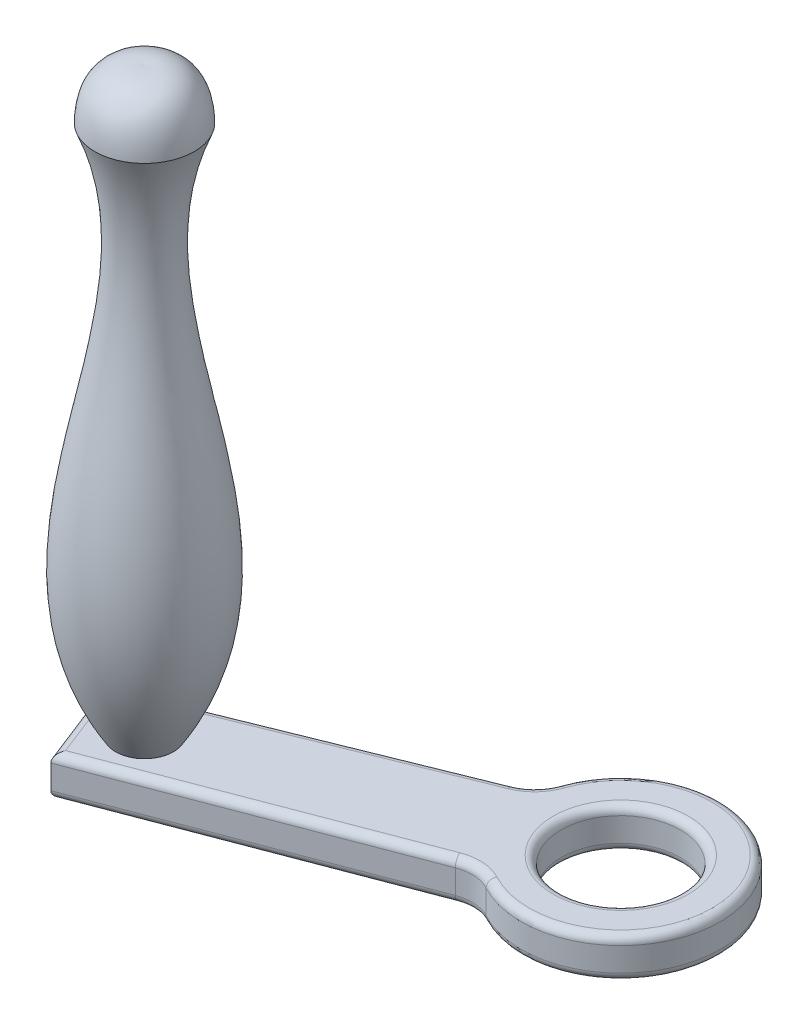
ISO-10303-21;
HEADER;
FILE_DESCRIPTION(('STEP AP214'),'2;1');
FILE_NAME('part.step','',(''),(''),'','','');
FILE_SCHEMA(('AUTOMOTIVE_DESIGN { 1 0 10303 214 1 1 1 1 }'));
ENDSEC;
DATA;
#1=APPLICATION_CONTEXT('core data for automotive mechanical design processes');
#2=APPLICATION_PROTOCOL_DEFINITION('international standard','automotive_design',2000,#1);
#3=PRODUCT_CONTEXT('',#1,'mechanical');
#4=PRODUCT('Part','Part','',(#3));
#5=PRODUCT_RELATED_PRODUCT_CATEGORY('part','',(#4));
#6=PRODUCT_DEFINITION_FORMATION('','',#4);
#7=PRODUCT_DEFINITION_CONTEXT('part definition',#1,'design');
#8=PRODUCT_DEFINITION('design','',#6,#7);
#9=PRODUCT_DEFINITION_SHAPE('','',#8);
#10=(LENGTH_UNIT() NAMED_UNIT(*) SI_UNIT(.MILLI.,.METRE.));
#11=(NAMED_UNIT(*) PLANE_ANGLE_UNIT() SI_UNIT($,.RADIAN.));
#12=(NAMED_UNIT(*) SI_UNIT($,.STERADIAN.) SOLID_ANGLE_UNIT());
#13=UNCERTAINTY_MEASURE_WITH_UNIT(LENGTH_MEASURE(1.E-05),#10,'distance_accuracy_value','');
#14=(GEOMETRIC_REPRESENTATION_CONTEXT(3) GLOBAL_UNCERTAINTY_ASSIGNED_CONTEXT((#13)) GLOBAL_UNIT_ASSIGNED_CONTEXT((#10,
#11,#12)) REPRESENTATION_CONTEXT('',''));
#15=CARTESIAN_POINT('',(0.,0.,0.));
#16=DIRECTION('',(0.,0.,1.));
#17=DIRECTION('',(1.,0.,0.));
#18=AXIS2_PLACEMENT_3D('',#15,#16,#17);
#19=CARTESIAN_POINT('',(-12.6687164985265,10.,146.410218970979));
#20=DIRECTION('',(0.,-1.,0.));
#21=DIRECTION('',(0.,0.,-1.));
#22=AXIS2_PLACEMENT_3D('',#19,#20,#21);
#23=PLANE('',#22);
#24=CARTESIAN_POINT('',(3.80708820162256,10.,115.530648710327));
#25=DIRECTION('',(0.,-1.,0.));
#26=DIRECTION('',(0.,0.,-1.));
#27=AXIS2_PLACEMENT_3D('',#24,#25,#26);
#28=CIRCLE('',#27,17.);
#29=CARTESIAN_POINT('',(3.80708820162256,10.,98.530648710327));
#30=VERTEX_POINT('',#29);
#31=EDGE_CURVE('P0_E11',#30,#30,#28,.T.);
#32=ORIENTED_EDGE('',*,*,#31,.T.);
#33=EDGE_LOOP('',(#32));
#34=FACE_BOUND('',#33,.T.);
#35=CARTESIAN_POINT('',(-29.2669525553891,10.,104.080416048781));
#36=DIRECTION('',(0.,-1.,0.));
#37=DIRECTION('',(0.,0.,-1.));
#38=AXIS2_PLACEMENT_3D('',#35,#36,#37);
#39=CIRCLE('',#38,12.);
#40=CARTESIAN_POINT('',(-17.9272814386994,10.,108.006210104168));
#41=VERTEX_POINT('',#40);
#42=CARTESIAN_POINT('',(-24.7742989756306,10.,115.207682730778));
#43=VERTEX_POINT('',#42);
#44=EDGE_CURVE('P0_E34',#41,#43,#39,.T.);
#45=ORIENTED_EDGE('',*,*,#44,.T.);
#46=DIRECTION('',(-0.927272223499759,0.,0.37438779831321));
#47=VECTOR('',#46,1.);
#48=CARTESIAN_POINT('',(-25.1977642307883,10.,115.378657575622));
#49=LINE('',#48,#47);
#50=CARTESIAN_POINT('',(-95.9644544726669,10.,143.950833773863));
#51=VERTEX_POINT('',#50);
#52=EDGE_CURVE('P0_E26',#43,#51,#49,.T.);
#53=ORIENTED_EDGE('',*,*,#52,.T.);
#54=DIRECTION('',(0.365055377330946,0.,0.930985806272986));
#55=VECTOR('',#54,1.);
#56=CARTESIAN_POINT('',(-84.0281622235487,10.,174.391471971561));
#57=LINE('',#56,#55);
#58=CARTESIAN_POINT('',(-88.6901060312929,10.,162.502307247061));
#59=VERTEX_POINT('',#58);
#60=EDGE_CURVE('P0_E173',#51,#59,#57,.T.);
#61=ORIENTED_EDGE('',*,*,#60,.T.);
#62=DIRECTION('',(0.934605466749449,0.,-0.355686127817834));
#63=VECTOR('',#62,1.);
#64=CARTESIAN_POINT('',(-16.9369500323406,10.,135.194953369986));
#65=LINE('',#64,#63);
#66=CARTESIAN_POINT('',(-16.9369500323406,10.,135.194953369986));
#67=VERTEX_POINT('',#66);
#68=EDGE_CURVE('P0_E175',#59,#67,#65,.T.);
#69=ORIENTED_EDGE('',*,*,#68,.T.);
#70=CARTESIAN_POINT('',(-12.6687164985265,10.,146.410218970979));
#71=DIRECTION('',(0.,-1.,0.));
#72=DIRECTION('',(0.,0.,-1.));
#73=AXIS2_PLACEMENT_3D('',#70,#71,#72);
#74=CIRCLE('',#73,12.);
#75=CARTESIAN_POINT('',(-7.01986917276113,10.,135.822937738756));
#76=VERTEX_POINT('',#75);
#77=EDGE_CURVE('P0_E177',#67,#76,#74,.T.);
#78=ORIENTED_EDGE('',*,*,#77,.T.);
#79=CARTESIAN_POINT('',(3.80708820162256,10.,115.530648710327));
#80=DIRECTION('',(0.,-1.,0.));
#81=DIRECTION('',(0.,0.,-1.));
#82=AXIS2_PLACEMENT_3D('',#79,#80,#81);
#83=CIRCLE('',#82,23.);
#84=EDGE_CURVE('P0_E39',#76,#41,#83,.F.);
#85=ORIENTED_EDGE('',*,*,#84,.T.);
#86=EDGE_LOOP('',(#45,#53,#61,#69,#78,#85));
#87=FACE_BOUND('',#86,.T.);
#88=ADVANCED_FACE('P0_F17',(#34,#87),#23,.F.);
#89=CARTESIAN_POINT('',(-12.6687164985265,0.,146.410218970979));
#90=DIRECTION('',(0.,-1.,0.));
#91=DIRECTION('',(0.,0.,-1.));
#92=AXIS2_PLACEMENT_3D('',#89,#90,#91);
#93=PLANE('',#92);
#94=CARTESIAN_POINT('',(3.80708820162256,0.,115.530648710327));
#95=DIRECTION('',(0.,-1.,0.));
#96=DIRECTION('',(0.,0.,-1.));
#97=AXIS2_PLACEMENT_3D('',#94,#95,#96);
#98=CIRCLE('',#97,17.);
#99=CARTESIAN_POINT('',(3.80708820162256,0.,98.530648710327));
#100=VERTEX_POINT('',#99);
#101=EDGE_CURVE('P0_E135',#100,#100,#98,.F.);
#102=ORIENTED_EDGE('',*,*,#101,.T.);
#103=EDGE_LOOP('',(#102));
#104=FACE_BOUND('',#103,.T.);
#105=CARTESIAN_POINT('',(-12.6687164985265,0.,146.410218970979));
#106=DIRECTION('',(0.,-1.,0.));
#107=DIRECTION('',(0.,0.,-1.));
#108=AXIS2_PLACEMENT_3D('',#105,#106,#107);
#109=CIRCLE('',#108,12.);
#110=CARTESIAN_POINT('',(-7.01986917276115,0.,135.822937738756));
#111=VERTEX_POINT('',#110);
#112=CARTESIAN_POINT('',(-16.9369500323406,0.,135.194953369986));
#113=VERTEX_POINT('',#112);
#114=EDGE_CURVE('P0_E134',#111,#113,#109,.F.);
#115=ORIENTED_EDGE('',*,*,#114,.T.);
#116=DIRECTION('',(0.934605466749449,0.,-0.355686127817834));
#117=VECTOR('',#116,1.);
#118=CARTESIAN_POINT('',(-90.5406359275986,0.,163.206569993904));
#119=LINE('',#118,#117);
#120=CARTESIAN_POINT('',(-88.6901060312929,0.,162.502307247061));
#121=VERTEX_POINT('',#120);
#122=EDGE_CURVE('P0_E113',#113,#121,#119,.F.);
#123=ORIENTED_EDGE('',*,*,#122,.T.);
#124=DIRECTION('',(0.365055377330946,0.,0.930985806272986));
#125=VECTOR('',#124,1.);
#126=CARTESIAN_POINT('',(-96.6872684445428,0.,142.107470848182));
#127=LINE('',#126,#125);
#128=CARTESIAN_POINT('',(-95.964454472667,0.,143.950833773863));
#129=VERTEX_POINT('',#128);
#130=EDGE_CURVE('P0_E123',#121,#129,#127,.F.);
#131=ORIENTED_EDGE('',*,*,#130,.T.);
#132=DIRECTION('',(-0.927272223499759,0.,0.37438779831321));
#133=VECTOR('',#132,1.);
#134=CARTESIAN_POINT('',(-24.7742989756306,0.,115.207682730778));
#135=LINE('',#134,#133);
#136=CARTESIAN_POINT('',(-24.7742989756306,0.,115.207682730778));
#137=VERTEX_POINT('',#136);
#138=EDGE_CURVE('P0_E129',#129,#137,#135,.F.);
#139=ORIENTED_EDGE('',*,*,#138,.T.);
#140=CARTESIAN_POINT('',(-29.2669525553891,0.,104.080416048781));
#141=DIRECTION('',(0.,-1.,0.));
#142=DIRECTION('',(0.,0.,-1.));
#143=AXIS2_PLACEMENT_3D('',#140,#141,#142);
#144=CIRCLE('',#143,12.);
#145=CARTESIAN_POINT('',(-17.9272814386994,0.,108.006210104168));
#146=VERTEX_POINT('',#145);
#147=EDGE_CURVE('P0_E235',#137,#146,#144,.F.);
#148=ORIENTED_EDGE('',*,*,#147,.T.);
#149=CARTESIAN_POINT('',(3.80708820162256,0.,115.530648710327));
#150=DIRECTION('',(0.,-1.,0.));
#151=DIRECTION('',(0.,0.,-1.));
#152=AXIS2_PLACEMENT_3D('',#149,#150,#151);
#153=CIRCLE('',#152,23.);
#154=EDGE_CURVE('P0_E140',#146,#111,#153,.T.);
#155=ORIENTED_EDGE('',*,*,#154,.T.);
#156=EDGE_LOOP('',(#115,#123,#131,#139,#148,#155));
#157=FACE_BOUND('',#156,.T.);
#158=ADVANCED_FACE('P0_F132',(#104,#157),#93,.T.);
#159=CARTESIAN_POINT('',(-98.5492400570888,10.,142.837581602844));
#160=DIRECTION('',(0.930985806272986,0.,-0.365055377330945));
#161=DIRECTION('',(-0.365055377330946,0.,-0.930985806272986));
#162=AXIS2_PLACEMENT_3D('',#159,#160,#161);
#163=PLANE('',#162);
#164=DIRECTION('',(0.,-1.,0.));
#165=VECTOR('',#164,1.);
#166=CARTESIAN_POINT('',(-98.5492400570888,10.,142.837581602844));
#167=LINE('',#166,#165);
#168=CARTESIAN_POINT('',(-98.5492400570888,8.,142.837581602844));
#169=VERTEX_POINT('',#168);
#170=CARTESIAN_POINT('',(-98.5492400570888,2.,142.837581602844));
#171=VERTEX_POINT('',#170);
#172=EDGE_CURVE('P0_E192',#169,#171,#167,.T.);
#173=ORIENTED_EDGE('',*,*,#172,.T.);
#174=DIRECTION('',(0.365055377330946,0.,0.930985806272986));
#175=VECTOR('',#174,1.);
#176=CARTESIAN_POINT('',(-89.829263671963,2.,165.075780927403));
#177=LINE('',#176,#175);
#178=CARTESIAN_POINT('',(-89.829263671963,2.,165.075780927403));
#179=VERTEX_POINT('',#178);
#180=EDGE_CURVE('P0_E171',#171,#179,#177,.T.);
#181=ORIENTED_EDGE('',*,*,#180,.T.);
#182=DIRECTION('',(0.,-1.,0.));
#183=VECTOR('',#182,1.);
#184=CARTESIAN_POINT('',(-89.829263671963,10.,165.075780927403));
#185=LINE('',#184,#183);
#186=CARTESIAN_POINT('',(-89.829263671963,8.,165.075780927403));
#187=VERTEX_POINT('',#186);
#188=EDGE_CURVE('P0_E130',#187,#179,#185,.T.);
#189=ORIENTED_EDGE('',*,*,#188,.F.);
#190=DIRECTION('',(0.365055377330946,0.,0.930985806272986));
#191=VECTOR('',#190,1.);
#192=CARTESIAN_POINT('',(-98.5492400570888,8.,142.837581602844));
#193=LINE('',#192,#191);
#194=EDGE_CURVE('P0_E169',#187,#169,#193,.F.);
#195=ORIENTED_EDGE('',*,*,#194,.T.);
#196=EDGE_LOOP('',(#173,#181,#189,#195));
#197=FACE_BOUND('',#196,.T.);
#198=ADVANCED_FACE('P0_F259',(#197),#163,.F.);
#199=CARTESIAN_POINT('',(-89.829263671963,10.,165.075780927403));
#200=DIRECTION('',(-0.355686127817834,0.,-0.934605466749449));
#201=DIRECTION('',(-0.934605466749449,0.,0.355686127817834));
#202=AXIS2_PLACEMENT_3D('',#199,#200,#201);
#203=PLANE('',#202);
#204=ORIENTED_EDGE('',*,*,#188,.T.);
#205=DIRECTION('',(0.934605466749449,0.,-0.355686127817834));
#206=VECTOR('',#205,1.);
#207=CARTESIAN_POINT('',(-16.2255777767048,2.,137.064164303485));
#208=LINE('',#207,#206);
#209=CARTESIAN_POINT('',(-16.2255777767048,2.,137.064164303485));
#210=VERTEX_POINT('',#209);
#211=EDGE_CURVE('P0_E116',#179,#210,#208,.T.);
#212=ORIENTED_EDGE('',*,*,#211,.T.);
#213=DIRECTION('',(0.,-1.,0.));
#214=VECTOR('',#213,1.);
#215=CARTESIAN_POINT('',(-16.2255777767048,10.,137.064164303485));
#216=LINE('',#215,#214);
#217=CARTESIAN_POINT('',(-16.2255777767048,8.,137.064164303485));
#218=VERTEX_POINT('',#217);
#219=EDGE_CURVE('P0_E221',#218,#210,#216,.T.);
#220=ORIENTED_EDGE('',*,*,#219,.F.);
#221=DIRECTION('',(0.934605466749449,0.,-0.355686127817834));
#222=VECTOR('',#221,1.);
#223=CARTESIAN_POINT('',(-89.829263671963,8.,165.075780927403));
#224=LINE('',#223,#222);
#225=EDGE_CURVE('P0_E149',#218,#187,#224,.F.);
#226=ORIENTED_EDGE('',*,*,#225,.T.);
#227=EDGE_LOOP('',(#204,#212,#220,#226));
#228=FACE_BOUND('',#227,.T.);
#229=ADVANCED_FACE('P0_F226',(#228),#203,.F.);
#230=CARTESIAN_POINT('',(-12.6687164985265,10.,146.410218970979));
#231=DIRECTION('',(0.,-1.,0.));
#232=DIRECTION('',(0.,0.,-1.));
#233=AXIS2_PLACEMENT_3D('',#230,#231,#232);
#234=CYLINDRICAL_SURFACE('',#233,10.);
#235=ORIENTED_EDGE('',*,*,#219,.T.);
#236=CARTESIAN_POINT('',(-12.6687164985265,2.,146.410218970979));
#237=DIRECTION('',(0.,-1.,0.));
#238=DIRECTION('',(0.,0.,-1.));
#239=AXIS2_PLACEMENT_3D('',#236,#237,#238);
#240=CIRCLE('',#239,10.);
#241=CARTESIAN_POINT('',(-7.96134372705537,2.,137.587484610793));
#242=VERTEX_POINT('',#241);
#243=EDGE_CURVE('P0_E154',#210,#242,#240,.T.);
#244=ORIENTED_EDGE('',*,*,#243,.T.);
#245=DIRECTION('',(0.,-1.,0.));
#246=VECTOR('',#245,1.);
#247=CARTESIAN_POINT('',(-7.96134372705537,10.,137.587484610793));
#248=LINE('',#247,#246);
#249=CARTESIAN_POINT('',(-7.96134372705537,8.,137.587484610793));
#250=VERTEX_POINT('',#249);
#251=EDGE_CURVE('P0_E223',#250,#242,#248,.T.);
#252=ORIENTED_EDGE('',*,*,#251,.F.);
#253=CARTESIAN_POINT('',(-12.6687164985265,8.,146.410218970979));
#254=DIRECTION('',(0.,-1.,0.));
#255=DIRECTION('',(0.,0.,-1.));
#256=AXIS2_PLACEMENT_3D('',#253,#254,#255);
#257=CIRCLE('',#256,10.);
#258=EDGE_CURVE('P0_E152',#250,#218,#257,.F.);
#259=ORIENTED_EDGE('',*,*,#258,.T.);
#260=EDGE_LOOP('',(#235,#244,#252,#259));
#261=FACE_BOUND('',#260,.T.);
#262=ADVANCED_FACE('P0_F220',(#261),#234,.F.);
#263=CARTESIAN_POINT('',(3.80708820162256,10.,115.530648710327));
#264=DIRECTION('',(0.,-1.,0.));
#265=DIRECTION('',(0.,0.,-1.));
#266=AXIS2_PLACEMENT_3D('',#263,#264,#265);
#267=CYLINDRICAL_SURFACE('',#266,25.);
#268=ORIENTED_EDGE('',*,*,#251,.T.);
#269=CARTESIAN_POINT('',(3.80708820162256,2.,115.530648710327));
#270=DIRECTION('',(0.,-1.,0.));
#271=DIRECTION('',(0.,0.,-1.));
#272=AXIS2_PLACEMENT_3D('',#269,#270,#271);
#273=CIRCLE('',#272,25.);
#274=CARTESIAN_POINT('',(-19.8172266248143,2.,107.351911094937));
#275=VERTEX_POINT('',#274);
#276=EDGE_CURVE('P0_E158',#242,#275,#273,.F.);
#277=ORIENTED_EDGE('',*,*,#276,.T.);
#278=DIRECTION('',(0.,-1.,0.));
#279=VECTOR('',#278,1.);
#280=CARTESIAN_POINT('',(-19.8172266248143,10.,107.351911094937));
#281=LINE('',#280,#279);
#282=CARTESIAN_POINT('',(-19.8172266248143,8.,107.351911094937));
#283=VERTEX_POINT('',#282);
#284=EDGE_CURVE('P0_E230',#283,#275,#281,.T.);
#285=ORIENTED_EDGE('',*,*,#284,.F.);
#286=CARTESIAN_POINT('',(3.80708820162256,8.,115.530648710327));
#287=DIRECTION('',(0.,-1.,0.));
#288=DIRECTION('',(0.,0.,-1.));
#289=AXIS2_PLACEMENT_3D('',#286,#287,#288);
#290=CIRCLE('',#289,25.);
#291=EDGE_CURVE('P0_E156',#283,#250,#290,.T.);
#292=ORIENTED_EDGE('',*,*,#291,.T.);
#293=EDGE_LOOP('',(#268,#277,#285,#292));
#294=FACE_BOUND('',#293,.T.);
#295=ADVANCED_FACE('P0_F247',(#294),#267,.T.);
#296=CARTESIAN_POINT('',(-29.2669525553891,10.,104.080416048781));
#297=DIRECTION('',(0.,-1.,0.));
#298=DIRECTION('',(0.,0.,-1.));
#299=AXIS2_PLACEMENT_3D('',#296,#297,#298);
#300=CYLINDRICAL_SURFACE('',#299,10.);
#301=ORIENTED_EDGE('',*,*,#284,.T.);
#302=CARTESIAN_POINT('',(-29.2669525553891,2.,104.080416048781));
#303=DIRECTION('',(0.,-1.,0.));
#304=DIRECTION('',(0.,0.,-1.));
#305=AXIS2_PLACEMENT_3D('',#302,#303,#304);
#306=CIRCLE('',#305,10.);
#307=CARTESIAN_POINT('',(-25.523074572257,2.,113.353138283779));
#308=VERTEX_POINT('',#307);
#309=EDGE_CURVE('P0_E162',#275,#308,#306,.T.);
#310=ORIENTED_EDGE('',*,*,#309,.T.);
#311=DIRECTION('',(0.,-1.,0.));
#312=VECTOR('',#311,1.);
#313=CARTESIAN_POINT('',(-25.523074572257,10.,113.353138283779));
#314=LINE('',#313,#312);
#315=CARTESIAN_POINT('',(-25.523074572257,8.,113.353138283779));
#316=VERTEX_POINT('',#315);
#317=EDGE_CURVE('P0_E252',#316,#308,#314,.T.);
#318=ORIENTED_EDGE('',*,*,#317,.F.);
#319=CARTESIAN_POINT('',(-29.2669525553891,8.,104.080416048781));
#320=DIRECTION('',(0.,-1.,0.));
#321=DIRECTION('',(0.,0.,-1.));
#322=AXIS2_PLACEMENT_3D('',#319,#320,#321);
#323=CIRCLE('',#322,10.);
#324=EDGE_CURVE('P0_E160',#316,#283,#323,.F.);
#325=ORIENTED_EDGE('',*,*,#324,.T.);
#326=EDGE_LOOP('',(#301,#310,#318,#325));
#327=FACE_BOUND('',#326,.T.);
#328=ADVANCED_FACE('P0_F270',(#327),#300,.F.);
#329=CARTESIAN_POINT('',(-98.5492400570888,10.,142.837581602844));
#330=DIRECTION('',(0.37438779831321,0.,0.927272223499759));
#331=DIRECTION('',(0.927272223499759,0.,-0.37438779831321));
#332=AXIS2_PLACEMENT_3D('',#329,#330,#331);
#333=PLANE('',#332);
#334=ORIENTED_EDGE('',*,*,#317,.T.);
#335=DIRECTION('',(-0.927272223499759,0.,0.37438779831321));
#336=VECTOR('',#335,1.);
#337=CARTESIAN_POINT('',(-98.5492400570888,2.,142.837581602844));
#338=LINE('',#337,#336);
#339=EDGE_CURVE('P0_E167',#308,#171,#338,.T.);
#340=ORIENTED_EDGE('',*,*,#339,.T.);
#341=ORIENTED_EDGE('',*,*,#172,.F.);
#342=DIRECTION('',(-0.927272223499759,0.,0.37438779831321));
#343=VECTOR('',#342,1.);
#344=CARTESIAN_POINT('',(-98.5492400570888,8.,142.837581602844));
#345=LINE('',#344,#343);
#346=EDGE_CURVE('P0_E164',#169,#316,#345,.F.);
#347=ORIENTED_EDGE('',*,*,#346,.T.);
#348=EDGE_LOOP('',(#334,#340,#341,#347));
#349=FACE_BOUND('',#348,.T.);
#350=ADVANCED_FACE('P0_F271',(#349),#333,.F.);
#351=CARTESIAN_POINT('',(3.80708820162256,10.,115.530648710327));
#352=DIRECTION('',(0.,-1.,0.));
#353=DIRECTION('',(0.,0.,-1.));
#354=AXIS2_PLACEMENT_3D('',#351,#352,#353);
#355=CYLINDRICAL_SURFACE('',#354,15.);
#356=CARTESIAN_POINT('',(3.80708820162256,2.,115.530648710327));
#357=DIRECTION('',(0.,-1.,0.));
#358=DIRECTION('',(0.,0.,-1.));
#359=AXIS2_PLACEMENT_3D('',#356,#357,#358);
#360=CIRCLE('',#359,15.);
#361=CARTESIAN_POINT('',(3.80708820162256,2.,100.530648710327));
#362=VERTEX_POINT('',#361);
#363=EDGE_CURVE('P0_E146',#362,#362,#360,.T.);
#364=ORIENTED_EDGE('',*,*,#363,.T.);
#365=EDGE_LOOP('',(#364));
#366=FACE_BOUND('',#365,.T.);
#367=CARTESIAN_POINT('',(3.80708820162256,8.,115.530648710327));
#368=DIRECTION('',(0.,-1.,0.));
#369=DIRECTION('',(0.,0.,-1.));
#370=AXIS2_PLACEMENT_3D('',#367,#368,#369);
#371=CIRCLE('',#370,15.);
#372=CARTESIAN_POINT('',(3.80708820162256,8.,100.530648710327));
#373=VERTEX_POINT('',#372);
#374=EDGE_CURVE('P0_E138',#373,#373,#371,.F.);
#375=ORIENTED_EDGE('',*,*,#374,.T.);
#376=EDGE_LOOP('',(#375));
#377=FACE_BOUND('',#376,.T.);
#378=ADVANCED_FACE('P0_F292',(#366,#377),#355,.F.);
#379=CARTESIAN_POINT('',(3.80708820162256,2.,115.530648710327));
#380=DIRECTION('',(0.,-1.,0.));
#381=DIRECTION('',(0.,0.,-1.));
#382=AXIS2_PLACEMENT_3D('',#379,#380,#381);
#383=TOROIDAL_SURFACE('',#382,17.,2.);
#384=ORIENTED_EDGE('',*,*,#363,.F.);
#385=EDGE_LOOP('',(#384));
#386=FACE_BOUND('',#385,.T.);
#387=ORIENTED_EDGE('',*,*,#101,.F.);
#388=EDGE_LOOP('',(#387));
#389=FACE_BOUND('',#388,.T.);
#390=ADVANCED_FACE('P0_F306',(#386,#389),#383,.T.);
#391=CARTESIAN_POINT('',(-29.2669525553891,2.,104.080416048781));
#392=DIRECTION('',(0.,-1.,0.));
#393=DIRECTION('',(0.,0.,-1.));
#394=AXIS2_PLACEMENT_3D('',#391,#392,#393);
#395=TOROIDAL_SURFACE('',#394,12.,2.);
#396=CARTESIAN_POINT('',(-17.9272814386994,2.,108.006210104168));
#397=DIRECTION('',(0.327149504615598,0.,-0.944972593057475));
#398=DIRECTION('',(-0.944972593057475,0.,-0.327149504615598));
#399=AXIS2_PLACEMENT_3D('',#396,#397,#398);
#400=CIRCLE('',#399,2.);
#401=EDGE_CURVE('P0_E186',#146,#275,#400,.T.);
#402=ORIENTED_EDGE('',*,*,#401,.F.);
#403=ORIENTED_EDGE('',*,*,#147,.F.);
#404=CARTESIAN_POINT('',(-24.7742989756306,2.,115.207682730778));
#405=DIRECTION('',(-0.927272223499759,0.,0.374387798313211));
#406=DIRECTION('',(0.374387798313211,0.,0.927272223499759));
#407=AXIS2_PLACEMENT_3D('',#404,#405,#406);
#408=CIRCLE('',#407,2.);
#409=EDGE_CURVE('P0_E189',#308,#137,#408,.T.);
#410=ORIENTED_EDGE('',*,*,#409,.F.);
#411=ORIENTED_EDGE('',*,*,#309,.F.);
#412=EDGE_LOOP('',(#402,#403,#410,#411));
#413=FACE_BOUND('',#412,.T.);
#414=ADVANCED_FACE('P0_F268',(#413),#395,.T.);
#415=CARTESIAN_POINT('',(-97.8004644604624,2.,144.692126049844));
#416=DIRECTION('',(0.927272223499759,0.,-0.37438779831321));
#417=DIRECTION('',(-0.37438779831321,0.,-0.927272223499759));
#418=AXIS2_PLACEMENT_3D('',#415,#416,#417);
#419=CYLINDRICAL_SURFACE('',#418,2.);
#420=ORIENTED_EDGE('',*,*,#409,.T.);
#421=ORIENTED_EDGE('',*,*,#138,.F.);
#422=CARTESIAN_POINT('',(-95.964454472667,2.,143.950833773863));
#423=DIRECTION('',(0.39556577347541,0.,-0.918437651043771));
#424=DIRECTION('',(-0.918437651043772,0.,-0.39556577347541));
#425=AXIS2_PLACEMENT_3D('',#422,#423,#424);
#426=ELLIPSE('',#425,2.81432885671047,2.);
#427=EDGE_CURVE('P0_E126',#171,#129,#426,.F.);
#428=ORIENTED_EDGE('',*,*,#427,.F.);
#429=ORIENTED_EDGE('',*,*,#339,.F.);
#430=EDGE_LOOP('',(#420,#421,#428,#429));
#431=FACE_BOUND('',#430,.T.);
#432=ADVANCED_FACE('P0_F265',(#431),#419,.T.);
#433=CARTESIAN_POINT('',(3.80708820162256,2.,115.530648710327));
#434=DIRECTION('',(0.,-1.,0.));
#435=DIRECTION('',(0.,0.,-1.));
#436=AXIS2_PLACEMENT_3D('',#433,#434,#435);
#437=TOROIDAL_SURFACE('',#436,23.,2.);
#438=ORIENTED_EDGE('',*,*,#401,.T.);
#439=ORIENTED_EDGE('',*,*,#276,.F.);
#440=CARTESIAN_POINT('',(-7.01986917276115,2.,135.822937738756));
#441=DIRECTION('',(-0.882273436018629,0.,-0.470737277147118));
#442=DIRECTION('',(-0.470737277147118,0.,0.882273436018629));
#443=AXIS2_PLACEMENT_3D('',#440,#441,#442);
#444=CIRCLE('',#443,2.);
#445=EDGE_CURVE('P0_E119',#111,#242,#444,.T.);
#446=ORIENTED_EDGE('',*,*,#445,.F.);
#447=ORIENTED_EDGE('',*,*,#154,.F.);
#448=EDGE_LOOP('',(#438,#439,#446,#447));
#449=FACE_BOUND('',#448,.T.);
#450=ADVANCED_FACE('P0_F242',(#449),#437,.T.);
#451=CARTESIAN_POINT('',(-96.6872684445428,2.,142.107470848182));
#452=DIRECTION('',(-0.365055377330946,0.,-0.930985806272986));
#453=DIRECTION('',(-0.930985806272986,0.,0.365055377330945));
#454=AXIS2_PLACEMENT_3D('',#451,#452,#453);
#455=CYLINDRICAL_SURFACE('',#454,2.);
#456=ORIENTED_EDGE('',*,*,#427,.T.);
#457=ORIENTED_EDGE('',*,*,#130,.F.);
#458=CARTESIAN_POINT('',(-88.6901060312929,2.,162.502307247061));
#459=DIRECTION('',(-0.914418254358033,0.,-0.404770621583146));
#460=DIRECTION('',(0.404770621583146,0.,-0.914418254358033));
#461=AXIS2_PLACEMENT_3D('',#458,#459,#460);
#462=ELLIPSE('',#461,2.81432885671047,2.);
#463=EDGE_CURVE('P0_E109',#179,#121,#462,.F.);
#464=ORIENTED_EDGE('',*,*,#463,.F.);
#465=ORIENTED_EDGE('',*,*,#180,.F.);
#466=EDGE_LOOP('',(#456,#457,#464,#465));
#467=FACE_BOUND('',#466,.T.);
#468=ADVANCED_FACE('P0_F124',(#467),#455,.T.);
#469=CARTESIAN_POINT('',(-12.6687164985265,2.,146.410218970979));
#470=DIRECTION('',(0.,-1.,0.));
#471=DIRECTION('',(0.,0.,-1.));
#472=AXIS2_PLACEMENT_3D('',#469,#470,#471);
#473=TOROIDAL_SURFACE('',#472,12.,2.);
#474=ORIENTED_EDGE('',*,*,#445,.T.);
#475=ORIENTED_EDGE('',*,*,#243,.F.);
#476=CARTESIAN_POINT('',(-16.9369500323406,2.,135.194953369986));
#477=DIRECTION('',(-0.934605466749449,0.,0.355686127817835));
#478=DIRECTION('',(0.355686127817835,0.,0.934605466749449));
#479=AXIS2_PLACEMENT_3D('',#476,#477,#478);
#480=CIRCLE('',#479,2.);
#481=EDGE_CURVE('P0_E120',#113,#210,#480,.T.);
#482=ORIENTED_EDGE('',*,*,#481,.F.);
#483=ORIENTED_EDGE('',*,*,#114,.F.);
#484=EDGE_LOOP('',(#474,#475,#482,#483));
#485=FACE_BOUND('',#484,.T.);
#486=ADVANCED_FACE('P0_F245',(#485),#473,.T.);
#487=CARTESIAN_POINT('',(-90.5406359275986,2.,163.206569993904));
#488=DIRECTION('',(-0.934605466749449,0.,0.355686127817834));
#489=DIRECTION('',(0.355686127817834,0.,0.934605466749449));
#490=AXIS2_PLACEMENT_3D('',#487,#488,#489);
#491=CYLINDRICAL_SURFACE('',#490,2.);
#492=ORIENTED_EDGE('',*,*,#463,.T.);
#493=ORIENTED_EDGE('',*,*,#122,.F.);
#494=ORIENTED_EDGE('',*,*,#481,.T.);
#495=ORIENTED_EDGE('',*,*,#211,.F.);
#496=EDGE_LOOP('',(#492,#493,#494,#495));
#497=FACE_BOUND('',#496,.T.);
#498=ADVANCED_FACE('P0_F111',(#497),#491,.T.);
#499=CARTESIAN_POINT('',(3.80708820162256,8.,115.530648710327));
#500=DIRECTION('',(0.,-1.,0.));
#501=DIRECTION('',(0.,0.,-1.));
#502=AXIS2_PLACEMENT_3D('',#499,#500,#501);
#503=TOROIDAL_SURFACE('',#502,17.,2.);
#504=ORIENTED_EDGE('',*,*,#31,.F.);
#505=EDGE_LOOP('',(#504));
#506=FACE_BOUND('',#505,.T.);
#507=ORIENTED_EDGE('',*,*,#374,.F.);
#508=EDGE_LOOP('',(#507));
#509=FACE_BOUND('',#508,.T.);
#510=ADVANCED_FACE('P0_F312',(#506,#509),#503,.T.);
#511=CARTESIAN_POINT('',(-12.6687164985265,8.,146.410218970979));
#512=DIRECTION('',(0.,-1.,0.));
#513=DIRECTION('',(0.,0.,-1.));
#514=AXIS2_PLACEMENT_3D('',#511,#512,#513);
#515=TOROIDAL_SURFACE('',#514,12.,2.);
#516=CARTESIAN_POINT('',(-16.9369500323406,8.,135.194953369986));
#517=DIRECTION('',(-0.934605466749449,0.,0.355686127817834));
#518=DIRECTION('',(0.355686127817834,0.,0.934605466749449));
#519=AXIS2_PLACEMENT_3D('',#516,#517,#518);
#520=CIRCLE('',#519,2.);
#521=EDGE_CURVE('P0_E202',#218,#67,#520,.T.);
#522=ORIENTED_EDGE('',*,*,#521,.F.);
#523=ORIENTED_EDGE('',*,*,#258,.F.);
#524=CARTESIAN_POINT('',(-7.01986917276113,8.,135.822937738756));
#525=DIRECTION('',(0.882273436018628,0.,0.47073727714712));
#526=DIRECTION('',(0.47073727714712,0.,-0.882273436018628));
#527=AXIS2_PLACEMENT_3D('',#524,#525,#526);
#528=CIRCLE('',#527,2.);
#529=EDGE_CURVE('P0_E21',#76,#250,#528,.T.);
#530=ORIENTED_EDGE('',*,*,#529,.F.);
#531=ORIENTED_EDGE('',*,*,#77,.F.);
#532=EDGE_LOOP('',(#522,#523,#530,#531));
#533=FACE_BOUND('',#532,.T.);
#534=ADVANCED_FACE('P0_F19',(#533),#515,.T.);
#535=CARTESIAN_POINT('',(3.80708820162256,8.,115.530648710327));
#536=DIRECTION('',(0.,-1.,0.));
#537=DIRECTION('',(0.,0.,-1.));
#538=AXIS2_PLACEMENT_3D('',#535,#536,#537);
#539=TOROIDAL_SURFACE('',#538,23.,2.);
#540=ORIENTED_EDGE('',*,*,#529,.T.);
#541=ORIENTED_EDGE('',*,*,#291,.F.);
#542=CARTESIAN_POINT('',(-17.9272814386994,8.,108.006210104168));
#543=DIRECTION('',(-0.327149504615598,0.,0.944972593057475));
#544=DIRECTION('',(0.944972593057475,0.,0.327149504615598));
#545=AXIS2_PLACEMENT_3D('',#542,#543,#544);
#546=CIRCLE('',#545,2.);
#547=EDGE_CURVE('P0_E200',#41,#283,#546,.T.);
#548=ORIENTED_EDGE('',*,*,#547,.F.);
#549=ORIENTED_EDGE('',*,*,#84,.F.);
#550=EDGE_LOOP('',(#540,#541,#548,#549));
#551=FACE_BOUND('',#550,.T.);
#552=ADVANCED_FACE('P0_F212',(#551),#539,.T.);
#553=CARTESIAN_POINT('',(-16.9369500323406,8.,135.194953369986));
#554=DIRECTION('',(0.934605466749449,0.,-0.355686127817834));
#555=DIRECTION('',(-0.355686127817834,0.,-0.934605466749449));
#556=AXIS2_PLACEMENT_3D('',#553,#554,#555);
#557=CYLINDRICAL_SURFACE('',#556,2.);
#558=ORIENTED_EDGE('',*,*,#521,.T.);
#559=ORIENTED_EDGE('',*,*,#68,.F.);
#560=CARTESIAN_POINT('',(-88.6901060312929,8.,162.502307247061));
#561=DIRECTION('',(0.914418254358033,0.,0.404770621583146));
#562=DIRECTION('',(-0.404770621583146,0.,0.914418254358033));
#563=AXIS2_PLACEMENT_3D('',#560,#561,#562);
#564=ELLIPSE('',#563,2.81432885671047,2.);
#565=EDGE_CURVE('P0_E197',#187,#59,#564,.F.);
#566=ORIENTED_EDGE('',*,*,#565,.F.);
#567=ORIENTED_EDGE('',*,*,#225,.F.);
#568=EDGE_LOOP('',(#558,#559,#566,#567));
#569=FACE_BOUND('',#568,.T.);
#570=ADVANCED_FACE('P0_F333',(#569),#557,.T.);
#571=CARTESIAN_POINT('',(-29.2669525553891,8.,104.080416048781));
#572=DIRECTION('',(0.,-1.,0.));
#573=DIRECTION('',(0.,0.,-1.));
#574=AXIS2_PLACEMENT_3D('',#571,#572,#573);
#575=TOROIDAL_SURFACE('',#574,12.,2.);
#576=ORIENTED_EDGE('',*,*,#547,.T.);
#577=ORIENTED_EDGE('',*,*,#324,.F.);
#578=CARTESIAN_POINT('',(-24.7742989756306,8.,115.207682730778));
#579=DIRECTION('',(-0.927272223499759,0.,0.374387798313209));
#580=DIRECTION('',(0.374387798313209,0.,0.927272223499759));
#581=AXIS2_PLACEMENT_3D('',#578,#579,#580);
#582=CIRCLE('',#581,2.);
#583=EDGE_CURVE('P0_E195',#43,#316,#582,.T.);
#584=ORIENTED_EDGE('',*,*,#583,.F.);
#585=ORIENTED_EDGE('',*,*,#44,.F.);
#586=EDGE_LOOP('',(#576,#577,#584,#585));
#587=FACE_BOUND('',#586,.T.);
#588=ADVANCED_FACE('P0_F330',(#587),#575,.T.);
#589=CARTESIAN_POINT('',(-84.0281622235487,8.,174.391471971561));
#590=DIRECTION('',(0.365055377330946,0.,0.930985806272986));
#591=DIRECTION('',(0.930985806272986,0.,-0.365055377330945));
#592=AXIS2_PLACEMENT_3D('',#589,#590,#591);
#593=CYLINDRICAL_SURFACE('',#592,2.);
#594=ORIENTED_EDGE('',*,*,#565,.T.);
#595=ORIENTED_EDGE('',*,*,#60,.F.);
#596=CARTESIAN_POINT('',(-95.964454472667,8.,143.950833773863));
#597=DIRECTION('',(-0.39556577347541,0.,0.918437651043771));
#598=DIRECTION('',(0.918437651043772,0.,0.39556577347541));
#599=AXIS2_PLACEMENT_3D('',#596,#597,#598);
#600=ELLIPSE('',#599,2.81432885671047,2.);
#601=EDGE_CURVE('P0_E193',#169,#51,#600,.F.);
#602=ORIENTED_EDGE('',*,*,#601,.F.);
#603=ORIENTED_EDGE('',*,*,#194,.F.);
#604=EDGE_LOOP('',(#594,#595,#602,#603));
#605=FACE_BOUND('',#604,.T.);
#606=ADVANCED_FACE('P0_F279',(#605),#593,.T.);
#607=CARTESIAN_POINT('',(-25.1977642307883,8.,115.378657575622));
#608=DIRECTION('',(-0.927272223499759,0.,0.37438779831321));
#609=DIRECTION('',(0.37438779831321,0.,0.927272223499759));
#610=AXIS2_PLACEMENT_3D('',#607,#608,#609);
#611=CYLINDRICAL_SURFACE('',#610,2.);
#612=ORIENTED_EDGE('',*,*,#583,.T.);
#613=ORIENTED_EDGE('',*,*,#346,.F.);
#614=ORIENTED_EDGE('',*,*,#601,.T.);
#615=ORIENTED_EDGE('',*,*,#52,.F.);
#616=EDGE_LOOP('',(#612,#613,#614,#615));
#617=FACE_BOUND('',#616,.T.);
#618=ADVANCED_FACE('P0_F274',(#617),#611,.T.);
#619=CLOSED_SHELL('',(#88,#158,#198,#229,#262,#295,#328,#350,#378,#390,#414,#432,#450,#468,#486,
#498,#510,#534,#552,#570,#588,#606,#618));
#620=MANIFOLD_SOLID_BREP('P0_B1',#619);
#621=CARTESIAN_POINT('',(-89.3992974375342,10.,149.229889798349));
#622=DIRECTION('',(0.,1.,0.));
#623=DIRECTION('',(-1.,0.,0.));
#624=AXIS2_PLACEMENT_3D('',#621,#622,#623);
#625=PLANE('',#624);
#626=CARTESIAN_POINT('',(-82.1347088060083,10.,149.229889798349));
#627=DIRECTION('',(0.,-1.,0.));
#628=DIRECTION('',(1.,0.,0.));
#629=AXIS2_PLACEMENT_3D('',#626,#627,#628);
#630=CIRCLE('',#629,7.26458863152583);
#631=CARTESIAN_POINT('',(-74.8701201744825,10.,149.229889798349));
#632=VERTEX_POINT('',#631);
#633=EDGE_CURVE('P1_E23',#632,#632,#630,.T.);
#634=ORIENTED_EDGE('',*,*,#633,.T.);
#635=EDGE_LOOP('',(#634));
#636=FACE_BOUND('',#635,.T.);
#637=ADVANCED_FACE('P1_F17',(#636),#625,.F.);
#638=CARTESIAN_POINT('',(-82.1347088060083,155.889898322498,149.229889798349));
#639=CARTESIAN_POINT('',(-94.3067198239933,156.963689721828,149.229889798349));
#640=CARTESIAN_POINT('',(-94.6222577247527,143.185074293903,149.229889798349));
#641=B_SPLINE_CURVE_WITH_KNOTS('',2,(#638,#639,#640),.UNSPECIFIED.,.F.,.F.,(3,3),(0.,1.),.UNSPECIFIED.);
#642=CARTESIAN_POINT('',(-82.1347088060083,10.,149.229889798349));
#643=DIRECTION('',(0.,-1.,0.));
#644=AXIS1_PLACEMENT('',#642,#643);
#645=SURFACE_OF_REVOLUTION('',#641,#644);
#646=CARTESIAN_POINT('',(-82.1347088060083,143.185074293903,149.229889798349));
#647=DIRECTION('',(0.,-1.,0.));
#648=DIRECTION('',(1.,0.,0.));
#649=AXIS2_PLACEMENT_3D('',#646,#647,#648);
#650=CIRCLE('',#649,12.4875489187444);
#651=CARTESIAN_POINT('',(-69.6471598872639,143.185074293903,149.229889798349));
#652=VERTEX_POINT('',#651);
#653=EDGE_CURVE('P1_E11',#652,#652,#650,.T.);
#654=ORIENTED_EDGE('',*,*,#653,.F.);
#655=EDGE_LOOP('',(#654));
#656=FACE_BOUND('',#655,.T.);
#657=CARTESIAN_POINT('',(-82.1347088060083,155.889898322498,149.229889798349));
#658=VERTEX_POINT('',#657);
#659=VERTEX_LOOP('',#658);
#660=FACE_BOUND('',#659,.T.);
#661=ADVANCED_FACE('P1_F26',(#656,#660),#645,.T.);
#662=CARTESIAN_POINT('',(-94.6222577247527,143.185074293903,149.229889798349));
#663=CARTESIAN_POINT('',(-76.4016673869078,99.1161197863677,149.229889798349));
#664=CARTESIAN_POINT('',(-117.447238702428,54.7752930592096,149.229889798349));
#665=CARTESIAN_POINT('',(-89.3992974375342,10.,149.229889798349));
#666=B_SPLINE_CURVE_WITH_KNOTS('',3,(#662,#663,#664,#665),.UNSPECIFIED.,.F.,.F.,(4,4),(0.,1.),.UNSPECIFIED.);
#667=CARTESIAN_POINT('',(-82.1347088060083,10.,149.229889798349));
#668=DIRECTION('',(0.,-1.,0.));
#669=AXIS1_PLACEMENT('',#667,#668);
#670=SURFACE_OF_REVOLUTION('',#666,#669);
#671=ORIENTED_EDGE('',*,*,#633,.F.);
#672=EDGE_LOOP('',(#671));
#673=FACE_BOUND('',#672,.T.);
#674=ORIENTED_EDGE('',*,*,#653,.T.);
#675=EDGE_LOOP('',(#674));
#676=FACE_BOUND('',#675,.T.);
#677=ADVANCED_FACE('P1_F28',(#673,#676),#670,.T.);
#678=CLOSED_SHELL('',(#637,#661,#677));
#679=MANIFOLD_SOLID_BREP('P1_B1',#678);
#680=ADVANCED_BREP_SHAPE_REPRESENTATION('',(#18,#620,#679),#14);
#681=SHAPE_DEFINITION_REPRESENTATION(#9,#680);
ENDSEC;
END-ISO-10303-21;
